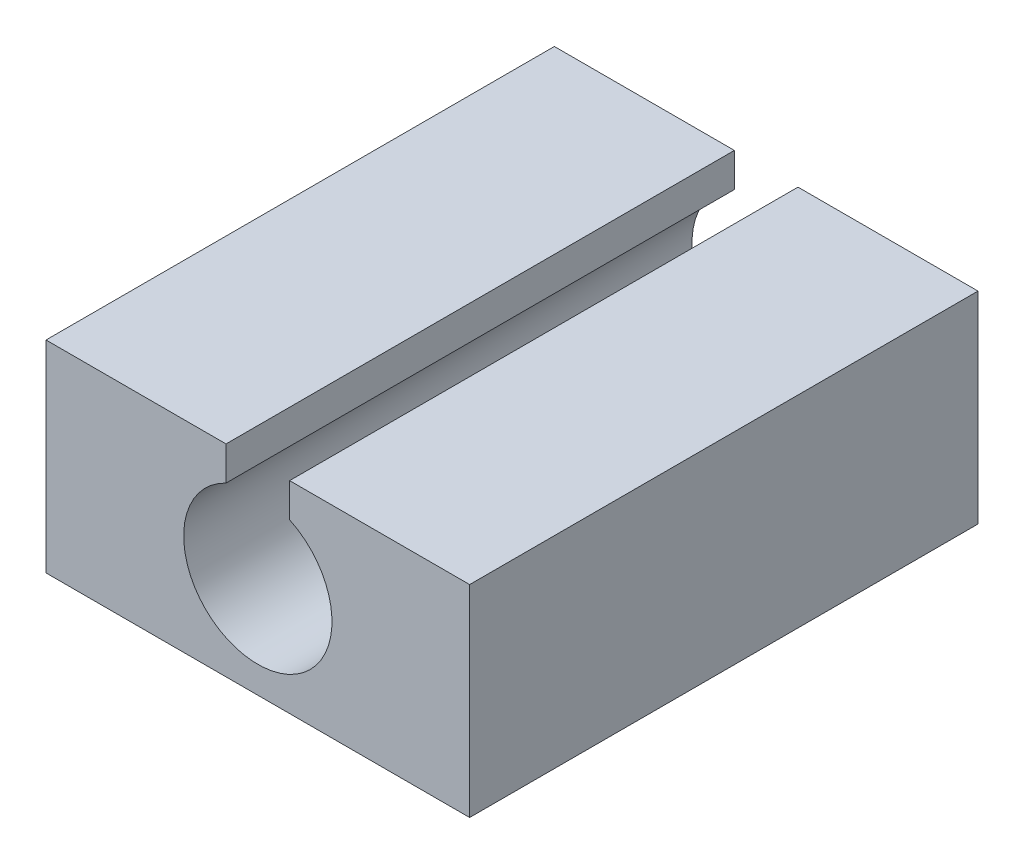
ISO-10303-21;
HEADER;
FILE_DESCRIPTION(('STEP AP214'),'2;1');
FILE_NAME('part.step','',(''),(''),'','','');
FILE_SCHEMA(('AUTOMOTIVE_DESIGN { 1 0 10303 214 1 1 1 1 }'));
ENDSEC;
DATA;
#1=APPLICATION_CONTEXT('core data for automotive mechanical design processes');
#2=APPLICATION_PROTOCOL_DEFINITION('international standard','automotive_design',2000,#1);
#3=PRODUCT_CONTEXT('',#1,'mechanical');
#4=PRODUCT('Part','Part','',(#3));
#5=PRODUCT_RELATED_PRODUCT_CATEGORY('part','',(#4));
#6=PRODUCT_DEFINITION_FORMATION('','',#4);
#7=PRODUCT_DEFINITION_CONTEXT('part definition',#1,'design');
#8=PRODUCT_DEFINITION('design','',#6,#7);
#9=PRODUCT_DEFINITION_SHAPE('','',#8);
#10=(LENGTH_UNIT() NAMED_UNIT(*) SI_UNIT(.MILLI.,.METRE.));
#11=(NAMED_UNIT(*) PLANE_ANGLE_UNIT() SI_UNIT($,.RADIAN.));
#12=(NAMED_UNIT(*) SI_UNIT($,.STERADIAN.) SOLID_ANGLE_UNIT());
#13=UNCERTAINTY_MEASURE_WITH_UNIT(LENGTH_MEASURE(1.E-05),#10,'distance_accuracy_value','');
#14=(GEOMETRIC_REPRESENTATION_CONTEXT(3) GLOBAL_UNCERTAINTY_ASSIGNED_CONTEXT((#13)) GLOBAL_UNIT_ASSIGNED_CONTEXT((#10,
#11,#12)) REPRESENTATION_CONTEXT('',''));
#15=CARTESIAN_POINT('',(0.,0.,0.));
#16=DIRECTION('',(0.,0.,1.));
#17=DIRECTION('',(1.,0.,0.));
#18=AXIS2_PLACEMENT_3D('',#15,#16,#17);
#19=CARTESIAN_POINT('',(0.,4.7625,0.));
#20=DIRECTION('',(0.,-1.,0.));
#21=DIRECTION('',(0.,0.,-1.));
#22=AXIS2_PLACEMENT_3D('',#19,#20,#21);
#23=PLANE('',#22);
#24=DIRECTION('',(-1.,0.,0.));
#25=VECTOR('',#24,1.);
#26=CARTESIAN_POINT('',(0.,4.7625,-12.));
#27=LINE('',#26,#25);
#28=CARTESIAN_POINT('',(10.,4.7625,-12.));
#29=VERTEX_POINT('',#28);
#30=CARTESIAN_POINT('',(5.75055465425432,4.7625,-12.));
#31=VERTEX_POINT('',#30);
#32=EDGE_CURVE('E109',#29,#31,#27,.T.);
#33=ORIENTED_EDGE('',*,*,#32,.T.);
#34=DIRECTION('',(0.,0.,-1.));
#35=VECTOR('',#34,1.);
#36=CARTESIAN_POINT('',(5.75055465425432,4.7625,-12.));
#37=LINE('',#36,#35);
#38=CARTESIAN_POINT('',(5.75055465425432,4.7625,0.));
#39=VERTEX_POINT('',#38);
#40=EDGE_CURVE('E95',#39,#31,#37,.T.);
#41=ORIENTED_EDGE('',*,*,#40,.F.);
#42=DIRECTION('',(1.,0.,0.));
#43=VECTOR('',#42,1.);
#44=CARTESIAN_POINT('',(0.,4.7625,0.));
#45=LINE('',#44,#43);
#46=CARTESIAN_POINT('',(10.,4.7625,0.));
#47=VERTEX_POINT('',#46);
#48=EDGE_CURVE('E157',#39,#47,#45,.T.);
#49=ORIENTED_EDGE('',*,*,#48,.T.);
#50=DIRECTION('',(0.,0.,-1.));
#51=VECTOR('',#50,1.);
#52=CARTESIAN_POINT('',(10.,4.7625,0.));
#53=LINE('',#52,#51);
#54=EDGE_CURVE('E116',#47,#29,#53,.T.);
#55=ORIENTED_EDGE('',*,*,#54,.T.);
#56=EDGE_LOOP('',(#33,#41,#49,#55));
#57=FACE_BOUND('',#56,.T.);
#58=ADVANCED_FACE('F33',(#57),#23,.F.);
#59=CARTESIAN_POINT('',(0.,4.7625,0.));
#60=DIRECTION('',(1.,0.,0.));
#61=DIRECTION('',(0.,0.,-1.));
#62=AXIS2_PLACEMENT_3D('',#59,#60,#61);
#63=PLANE('',#62);
#64=DIRECTION('',(0.,0.,1.));
#65=VECTOR('',#64,1.);
#66=CARTESIAN_POINT('',(0.,0.,0.));
#67=LINE('',#66,#65);
#68=CARTESIAN_POINT('',(0.,0.,-12.));
#69=VERTEX_POINT('',#68);
#70=CARTESIAN_POINT('',(0.,0.,0.));
#71=VERTEX_POINT('',#70);
#72=EDGE_CURVE('E127',#69,#71,#67,.T.);
#73=ORIENTED_EDGE('',*,*,#72,.T.);
#74=DIRECTION('',(0.,-1.,0.));
#75=VECTOR('',#74,1.);
#76=CARTESIAN_POINT('',(0.,4.7625,0.));
#77=LINE('',#76,#75);
#78=CARTESIAN_POINT('',(0.,4.7625,0.));
#79=VERTEX_POINT('',#78);
#80=EDGE_CURVE('E141',#79,#71,#77,.T.);
#81=ORIENTED_EDGE('',*,*,#80,.F.);
#82=DIRECTION('',(0.,0.,1.));
#83=VECTOR('',#82,1.);
#84=CARTESIAN_POINT('',(0.,4.7625,0.));
#85=LINE('',#84,#83);
#86=CARTESIAN_POINT('',(0.,4.7625,-12.));
#87=VERTEX_POINT('',#86);
#88=EDGE_CURVE('E135',#87,#79,#85,.T.);
#89=ORIENTED_EDGE('',*,*,#88,.F.);
#90=DIRECTION('',(0.,-1.,0.));
#91=VECTOR('',#90,1.);
#92=CARTESIAN_POINT('',(0.,4.7625,-12.));
#93=LINE('',#92,#91);
#94=EDGE_CURVE('E118',#87,#69,#93,.T.);
#95=ORIENTED_EDGE('',*,*,#94,.T.);
#96=EDGE_LOOP('',(#73,#81,#89,#95));
#97=FACE_BOUND('',#96,.T.);
#98=ADVANCED_FACE('F35',(#97),#63,.F.);
#99=CARTESIAN_POINT('',(0.,4.7625,0.));
#100=DIRECTION('',(0.,0.,-1.));
#101=DIRECTION('',(-1.,0.,0.));
#102=AXIS2_PLACEMENT_3D('',#99,#100,#101);
#103=PLANE('',#102);
#104=ORIENTED_EDGE('',*,*,#48,.F.);
#105=DIRECTION('',(0.,1.,0.));
#106=VECTOR('',#105,1.);
#107=CARTESIAN_POINT('',(5.75055465425432,3.7625,0.));
#108=LINE('',#107,#106);
#109=CARTESIAN_POINT('',(5.75055465425432,3.96212561527692,0.));
#110=VERTEX_POINT('',#109);
#111=EDGE_CURVE('E98',#110,#39,#108,.T.);
#112=ORIENTED_EDGE('',*,*,#111,.F.);
#113=CARTESIAN_POINT('',(5.,2.38125,0.));
#114=DIRECTION('',(0.,0.,1.));
#115=DIRECTION('',(1.,0.,0.));
#116=AXIS2_PLACEMENT_3D('',#113,#114,#115);
#117=CIRCLE('',#116,1.75);
#118=CARTESIAN_POINT('',(4.24944534574568,3.96212561527692,0.));
#119=VERTEX_POINT('',#118);
#120=EDGE_CURVE('E144',#119,#110,#117,.T.);
#121=ORIENTED_EDGE('',*,*,#120,.F.);
#122=DIRECTION('',(0.,1.,0.));
#123=VECTOR('',#122,1.);
#124=CARTESIAN_POINT('',(4.24944534574568,3.7625,0.));
#125=LINE('',#124,#123);
#126=CARTESIAN_POINT('',(4.24944534574568,4.7625,0.));
#127=VERTEX_POINT('',#126);
#128=EDGE_CURVE('E55',#119,#127,#125,.T.);
#129=ORIENTED_EDGE('',*,*,#128,.T.);
#130=EDGE_CURVE('E158',#79,#127,#45,.T.);
#131=ORIENTED_EDGE('',*,*,#130,.F.);
#132=ORIENTED_EDGE('',*,*,#80,.T.);
#133=DIRECTION('',(1.,0.,0.));
#134=VECTOR('',#133,1.);
#135=CARTESIAN_POINT('',(0.,0.,0.));
#136=LINE('',#135,#134);
#137=CARTESIAN_POINT('',(10.,0.,0.));
#138=VERTEX_POINT('',#137);
#139=EDGE_CURVE('E130',#71,#138,#136,.T.);
#140=ORIENTED_EDGE('',*,*,#139,.T.);
#141=DIRECTION('',(0.,-1.,0.));
#142=VECTOR('',#141,1.);
#143=CARTESIAN_POINT('',(10.,4.7625,0.));
#144=LINE('',#143,#142);
#145=EDGE_CURVE('E138',#47,#138,#144,.T.);
#146=ORIENTED_EDGE('',*,*,#145,.F.);
#147=EDGE_LOOP('',(#104,#112,#121,#129,#131,#132,#140,#146));
#148=FACE_BOUND('',#147,.T.);
#149=ADVANCED_FACE('F150',(#148),#103,.F.);
#150=CARTESIAN_POINT('',(10.,4.7625,0.));
#151=DIRECTION('',(-1.,0.,0.));
#152=DIRECTION('',(0.,0.,1.));
#153=AXIS2_PLACEMENT_3D('',#150,#151,#152);
#154=PLANE('',#153);
#155=DIRECTION('',(0.,0.,-1.));
#156=VECTOR('',#155,1.);
#157=CARTESIAN_POINT('',(10.,0.,0.));
#158=LINE('',#157,#156);
#159=CARTESIAN_POINT('',(10.,0.,-12.));
#160=VERTEX_POINT('',#159);
#161=EDGE_CURVE('E132',#138,#160,#158,.T.);
#162=ORIENTED_EDGE('',*,*,#161,.T.);
#163=DIRECTION('',(0.,-1.,0.));
#164=VECTOR('',#163,1.);
#165=CARTESIAN_POINT('',(10.,4.7625,-12.));
#166=LINE('',#165,#164);
#167=EDGE_CURVE('E122',#29,#160,#166,.T.);
#168=ORIENTED_EDGE('',*,*,#167,.F.);
#169=ORIENTED_EDGE('',*,*,#54,.F.);
#170=ORIENTED_EDGE('',*,*,#145,.T.);
#171=EDGE_LOOP('',(#162,#168,#169,#170));
#172=FACE_BOUND('',#171,.T.);
#173=ADVANCED_FACE('F164',(#172),#154,.F.);
#174=CARTESIAN_POINT('',(0.,4.7625,-12.));
#175=DIRECTION('',(0.,0.,1.));
#176=DIRECTION('',(1.,0.,0.));
#177=AXIS2_PLACEMENT_3D('',#174,#175,#176);
#178=PLANE('',#177);
#179=CARTESIAN_POINT('',(5.,2.38125,-12.));
#180=DIRECTION('',(0.,0.,1.));
#181=DIRECTION('',(1.,0.,0.));
#182=AXIS2_PLACEMENT_3D('',#179,#180,#181);
#183=CIRCLE('',#182,1.75);
#184=CARTESIAN_POINT('',(4.24944534574568,3.96212561527692,-12.));
#185=VERTEX_POINT('',#184);
#186=CARTESIAN_POINT('',(5.75055465425432,3.96212561527692,-12.));
#187=VERTEX_POINT('',#186);
#188=EDGE_CURVE('E112',#185,#187,#183,.T.);
#189=ORIENTED_EDGE('',*,*,#188,.T.);
#190=DIRECTION('',(0.,1.,0.));
#191=VECTOR('',#190,1.);
#192=CARTESIAN_POINT('',(5.75055465425432,3.7625,-12.));
#193=LINE('',#192,#191);
#194=EDGE_CURVE('E48',#187,#31,#193,.T.);
#195=ORIENTED_EDGE('',*,*,#194,.T.);
#196=ORIENTED_EDGE('',*,*,#32,.F.);
#197=ORIENTED_EDGE('',*,*,#167,.T.);
#198=DIRECTION('',(-1.,0.,0.));
#199=VECTOR('',#198,1.);
#200=CARTESIAN_POINT('',(0.,0.,-12.));
#201=LINE('',#200,#199);
#202=EDGE_CURVE('E134',#160,#69,#201,.T.);
#203=ORIENTED_EDGE('',*,*,#202,.T.);
#204=ORIENTED_EDGE('',*,*,#94,.F.);
#205=CARTESIAN_POINT('',(4.24944534574568,4.7625,-12.));
#206=VERTEX_POINT('',#205);
#207=EDGE_CURVE('E119',#206,#87,#27,.T.);
#208=ORIENTED_EDGE('',*,*,#207,.F.);
#209=DIRECTION('',(0.,1.,0.));
#210=VECTOR('',#209,1.);
#211=CARTESIAN_POINT('',(4.24944534574568,3.7625,-12.));
#212=LINE('',#211,#210);
#213=EDGE_CURVE('E113',#185,#206,#212,.T.);
#214=ORIENTED_EDGE('',*,*,#213,.F.);
#215=EDGE_LOOP('',(#189,#195,#196,#197,#203,#204,#208,#214));
#216=FACE_BOUND('',#215,.T.);
#217=ADVANCED_FACE('F107',(#216),#178,.F.);
#218=ORIENTED_EDGE('',*,*,#130,.T.);
#219=DIRECTION('',(0.,0.,1.));
#220=VECTOR('',#219,1.);
#221=CARTESIAN_POINT('',(4.24944534574568,4.7625,-12.));
#222=LINE('',#221,#220);
#223=EDGE_CURVE('E102',#206,#127,#222,.T.);
#224=ORIENTED_EDGE('',*,*,#223,.F.);
#225=ORIENTED_EDGE('',*,*,#207,.T.);
#226=ORIENTED_EDGE('',*,*,#88,.T.);
#227=EDGE_LOOP('',(#218,#224,#225,#226));
#228=FACE_BOUND('',#227,.T.);
#229=ADVANCED_FACE('F174',(#228),#23,.F.);
#230=CARTESIAN_POINT('',(0.,0.,0.));
#231=DIRECTION('',(0.,-1.,0.));
#232=DIRECTION('',(0.,0.,-1.));
#233=AXIS2_PLACEMENT_3D('',#230,#231,#232);
#234=PLANE('',#233);
#235=ORIENTED_EDGE('',*,*,#72,.F.);
#236=ORIENTED_EDGE('',*,*,#202,.F.);
#237=ORIENTED_EDGE('',*,*,#161,.F.);
#238=ORIENTED_EDGE('',*,*,#139,.F.);
#239=EDGE_LOOP('',(#235,#236,#237,#238));
#240=FACE_BOUND('',#239,.T.);
#241=ADVANCED_FACE('F169',(#240),#234,.T.);
#242=CARTESIAN_POINT('',(5.,2.38125,-12.7625));
#243=DIRECTION('',(0.,0.,1.));
#244=DIRECTION('',(1.,0.,0.));
#245=AXIS2_PLACEMENT_3D('',#242,#243,#244);
#246=CYLINDRICAL_SURFACE('',#245,1.75);
#247=ORIENTED_EDGE('',*,*,#120,.T.);
#248=DIRECTION('',(0.,0.,1.));
#249=VECTOR('',#248,1.);
#250=CARTESIAN_POINT('',(5.75055465425432,3.96212561527692,-12.7625));
#251=LINE('',#250,#249);
#252=EDGE_CURVE('E11',#110,#187,#251,.F.);
#253=ORIENTED_EDGE('',*,*,#252,.T.);
#254=ORIENTED_EDGE('',*,*,#188,.F.);
#255=DIRECTION('',(0.,0.,1.));
#256=VECTOR('',#255,1.);
#257=CARTESIAN_POINT('',(4.24944534574568,3.96212561527692,-12.7625));
#258=LINE('',#257,#256);
#259=EDGE_CURVE('E41',#185,#119,#258,.T.);
#260=ORIENTED_EDGE('',*,*,#259,.T.);
#261=EDGE_LOOP('',(#247,#253,#254,#260));
#262=FACE_BOUND('',#261,.T.);
#263=ADVANCED_FACE('F148',(#262),#246,.F.);
#264=CARTESIAN_POINT('',(4.24944534574568,3.7625,-12.));
#265=DIRECTION('',(-1.,0.,0.));
#266=DIRECTION('',(0.,0.,1.));
#267=AXIS2_PLACEMENT_3D('',#264,#265,#266);
#268=PLANE('',#267);
#269=ORIENTED_EDGE('',*,*,#213,.T.);
#270=ORIENTED_EDGE('',*,*,#223,.T.);
#271=ORIENTED_EDGE('',*,*,#128,.F.);
#272=ORIENTED_EDGE('',*,*,#259,.F.);
#273=EDGE_LOOP('',(#269,#270,#271,#272));
#274=FACE_BOUND('',#273,.T.);
#275=ADVANCED_FACE('F177',(#274),#268,.F.);
#276=CARTESIAN_POINT('',(5.75055465425432,3.7625,-12.));
#277=DIRECTION('',(1.,0.,0.));
#278=DIRECTION('',(0.,0.,-1.));
#279=AXIS2_PLACEMENT_3D('',#276,#277,#278);
#280=PLANE('',#279);
#281=ORIENTED_EDGE('',*,*,#111,.T.);
#282=ORIENTED_EDGE('',*,*,#40,.T.);
#283=ORIENTED_EDGE('',*,*,#194,.F.);
#284=ORIENTED_EDGE('',*,*,#252,.F.);
#285=EDGE_LOOP('',(#281,#282,#283,#284));
#286=FACE_BOUND('',#285,.T.);
#287=ADVANCED_FACE('F96',(#286),#280,.F.);
#288=CLOSED_SHELL('',(#58,#98,#149,#173,#217,#229,#241,#263,#275,#287));
#289=MANIFOLD_SOLID_BREP('B2',#288);
#290=ADVANCED_BREP_SHAPE_REPRESENTATION('',(#18,#289),#14);
#291=SHAPE_DEFINITION_REPRESENTATION(#9,#290);
ENDSEC;
END-ISO-10303-21;
